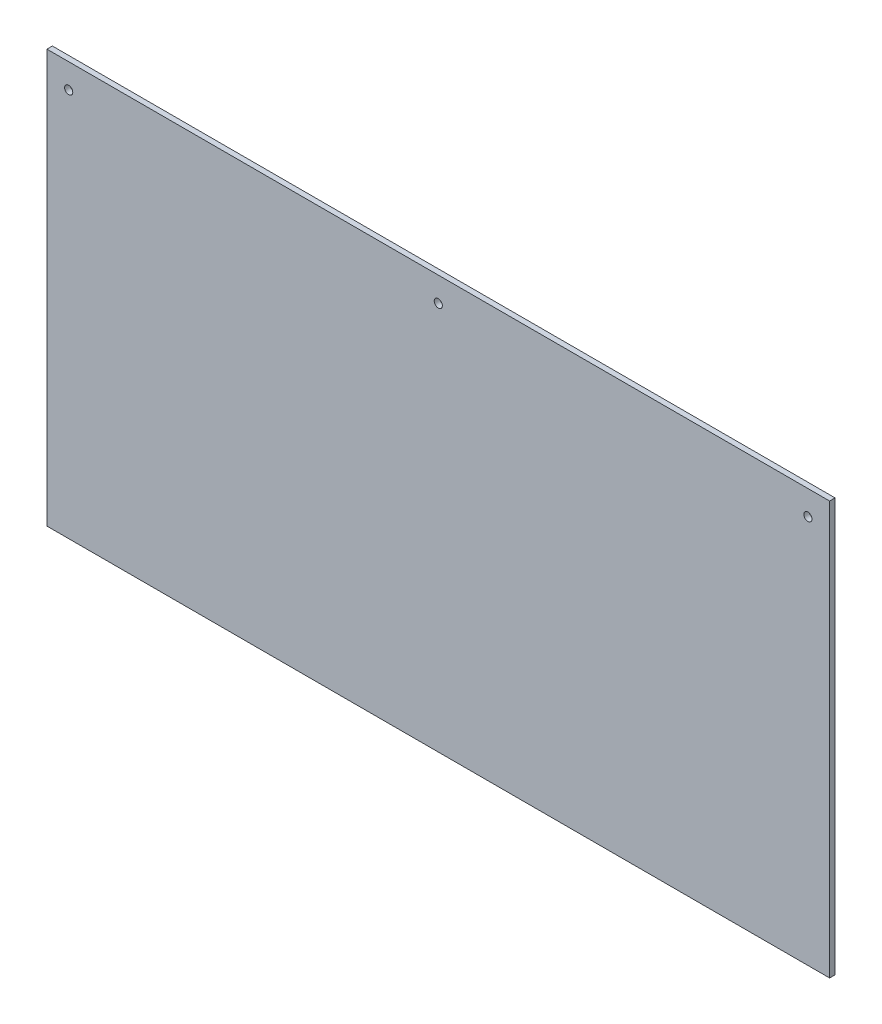
ISO-10303-21;
HEADER;
FILE_DESCRIPTION(('STEP AP214'),'2;1');
FILE_NAME('part.step','',(''),(''),'','','');
FILE_SCHEMA(('AUTOMOTIVE_DESIGN { 1 0 10303 214 1 1 1 1 }'));
ENDSEC;
DATA;
#1=APPLICATION_CONTEXT('core data for automotive mechanical design processes');
#2=APPLICATION_PROTOCOL_DEFINITION('international standard','automotive_design',2000,#1);
#3=PRODUCT_CONTEXT('',#1,'mechanical');
#4=PRODUCT('Part','Part','',(#3));
#5=PRODUCT_RELATED_PRODUCT_CATEGORY('part','',(#4));
#6=PRODUCT_DEFINITION_FORMATION('','',#4);
#7=PRODUCT_DEFINITION_CONTEXT('part definition',#1,'design');
#8=PRODUCT_DEFINITION('design','',#6,#7);
#9=PRODUCT_DEFINITION_SHAPE('','',#8);
#10=(LENGTH_UNIT() NAMED_UNIT(*) SI_UNIT(.MILLI.,.METRE.));
#11=(NAMED_UNIT(*) PLANE_ANGLE_UNIT() SI_UNIT($,.RADIAN.));
#12=(NAMED_UNIT(*) SI_UNIT($,.STERADIAN.) SOLID_ANGLE_UNIT());
#13=UNCERTAINTY_MEASURE_WITH_UNIT(LENGTH_MEASURE(1.E-05),#10,'distance_accuracy_value','');
#14=(GEOMETRIC_REPRESENTATION_CONTEXT(3) GLOBAL_UNCERTAINTY_ASSIGNED_CONTEXT((#13)) GLOBAL_UNIT_ASSIGNED_CONTEXT((#10,
#11,#12)) REPRESENTATION_CONTEXT('',''));
#15=CARTESIAN_POINT('',(0.,0.,0.));
#16=DIRECTION('',(0.,0.,1.));
#17=DIRECTION('',(1.,0.,0.));
#18=AXIS2_PLACEMENT_3D('',#15,#16,#17);
#19=CARTESIAN_POINT('',(0.,0.,6.35));
#20=DIRECTION('',(0.,0.,1.));
#21=DIRECTION('',(1.,0.,0.));
#22=AXIS2_PLACEMENT_3D('',#19,#20,#21);
#23=PLANE('',#22);
#24=CARTESIAN_POINT('',(889.,454.025,6.35));
#25=DIRECTION('',(0.,0.,1.));
#26=DIRECTION('',(1.,0.,0.));
#27=AXIS2_PLACEMENT_3D('',#24,#25,#26);
#28=CIRCLE('',#27,4.7625);
#29=CARTESIAN_POINT('',(893.7625,454.025,6.35));
#30=VERTEX_POINT('',#29);
#31=EDGE_CURVE('E88',#30,#30,#28,.F.);
#32=ORIENTED_EDGE('',*,*,#31,.T.);
#33=EDGE_LOOP('',(#32));
#34=FACE_BOUND('',#33,.T.);
#35=CARTESIAN_POINT('',(457.2,454.025,6.35));
#36=DIRECTION('',(0.,0.,1.));
#37=DIRECTION('',(1.,0.,0.));
#38=AXIS2_PLACEMENT_3D('',#35,#36,#37);
#39=CIRCLE('',#38,4.7625);
#40=CARTESIAN_POINT('',(461.9625,454.025,6.35));
#41=VERTEX_POINT('',#40);
#42=EDGE_CURVE('E90',#41,#41,#39,.F.);
#43=ORIENTED_EDGE('',*,*,#42,.T.);
#44=EDGE_LOOP('',(#43));
#45=FACE_BOUND('',#44,.T.);
#46=CARTESIAN_POINT('',(25.4,454.025,6.35));
#47=DIRECTION('',(0.,0.,1.));
#48=DIRECTION('',(1.,0.,0.));
#49=AXIS2_PLACEMENT_3D('',#46,#47,#48);
#50=CIRCLE('',#49,4.7625);
#51=CARTESIAN_POINT('',(30.1625,454.025,6.35));
#52=VERTEX_POINT('',#51);
#53=EDGE_CURVE('E19',#52,#52,#50,.F.);
#54=ORIENTED_EDGE('',*,*,#53,.T.);
#55=EDGE_LOOP('',(#54));
#56=FACE_BOUND('',#55,.T.);
#57=DIRECTION('',(0.,1.,0.));
#58=VECTOR('',#57,1.);
#59=CARTESIAN_POINT('',(0.,482.6,6.35));
#60=LINE('',#59,#58);
#61=CARTESIAN_POINT('',(0.,0.,6.35));
#62=VERTEX_POINT('',#61);
#63=CARTESIAN_POINT('',(0.,482.6,6.35));
#64=VERTEX_POINT('',#63);
#65=EDGE_CURVE('E70',#62,#64,#60,.T.);
#66=ORIENTED_EDGE('',*,*,#65,.F.);
#67=DIRECTION('',(1.,0.,0.));
#68=VECTOR('',#67,1.);
#69=CARTESIAN_POINT('',(0.,0.,6.35));
#70=LINE('',#69,#68);
#71=CARTESIAN_POINT('',(914.4,0.,6.35));
#72=VERTEX_POINT('',#71);
#73=EDGE_CURVE('E67',#72,#62,#70,.F.);
#74=ORIENTED_EDGE('',*,*,#73,.F.);
#75=DIRECTION('',(0.,1.,0.));
#76=VECTOR('',#75,1.);
#77=CARTESIAN_POINT('',(914.4,0.,6.35));
#78=LINE('',#77,#76);
#79=CARTESIAN_POINT('',(914.4,482.6,6.35));
#80=VERTEX_POINT('',#79);
#81=EDGE_CURVE('E58',#80,#72,#78,.F.);
#82=ORIENTED_EDGE('',*,*,#81,.F.);
#83=DIRECTION('',(1.,0.,0.));
#84=VECTOR('',#83,1.);
#85=CARTESIAN_POINT('',(914.4,482.6,6.35));
#86=LINE('',#85,#84);
#87=EDGE_CURVE('E53',#64,#80,#86,.T.);
#88=ORIENTED_EDGE('',*,*,#87,.F.);
#89=EDGE_LOOP('',(#66,#74,#82,#88));
#90=FACE_BOUND('',#89,.T.);
#91=ADVANCED_FACE('F16',(#34,#45,#56,#90),#23,.T.);
#92=CARTESIAN_POINT('',(0.,0.,0.));
#93=DIRECTION('',(0.,-1.,0.));
#94=DIRECTION('',(0.,0.,-1.));
#95=AXIS2_PLACEMENT_3D('',#92,#93,#94);
#96=PLANE('',#95);
#97=DIRECTION('',(0.,0.,1.));
#98=VECTOR('',#97,1.);
#99=CARTESIAN_POINT('',(0.,0.,0.));
#100=LINE('',#99,#98);
#101=CARTESIAN_POINT('',(0.,0.,0.));
#102=VERTEX_POINT('',#101);
#103=EDGE_CURVE('E98',#102,#62,#100,.T.);
#104=ORIENTED_EDGE('',*,*,#103,.F.);
#105=DIRECTION('',(1.,0.,0.));
#106=VECTOR('',#105,1.);
#107=CARTESIAN_POINT('',(0.,0.,0.));
#108=LINE('',#107,#106);
#109=CARTESIAN_POINT('',(914.4,0.,0.));
#110=VERTEX_POINT('',#109);
#111=EDGE_CURVE('E77',#102,#110,#108,.T.);
#112=ORIENTED_EDGE('',*,*,#111,.T.);
#113=DIRECTION('',(0.,0.,-1.));
#114=VECTOR('',#113,1.);
#115=CARTESIAN_POINT('',(914.4,0.,0.));
#116=LINE('',#115,#114);
#117=EDGE_CURVE('E63',#72,#110,#116,.T.);
#118=ORIENTED_EDGE('',*,*,#117,.F.);
#119=ORIENTED_EDGE('',*,*,#73,.T.);
#120=EDGE_LOOP('',(#104,#112,#118,#119));
#121=FACE_BOUND('',#120,.T.);
#122=ADVANCED_FACE('F76',(#121),#96,.T.);
#123=CARTESIAN_POINT('',(914.4,0.,0.));
#124=DIRECTION('',(1.,0.,0.));
#125=DIRECTION('',(0.,0.,-1.));
#126=AXIS2_PLACEMENT_3D('',#123,#124,#125);
#127=PLANE('',#126);
#128=ORIENTED_EDGE('',*,*,#117,.T.);
#129=DIRECTION('',(0.,1.,0.));
#130=VECTOR('',#129,1.);
#131=CARTESIAN_POINT('',(914.4,0.,0.));
#132=LINE('',#131,#130);
#133=CARTESIAN_POINT('',(914.4,482.6,0.));
#134=VERTEX_POINT('',#133);
#135=EDGE_CURVE('E109',#110,#134,#132,.T.);
#136=ORIENTED_EDGE('',*,*,#135,.T.);
#137=DIRECTION('',(0.,0.,1.));
#138=VECTOR('',#137,1.);
#139=CARTESIAN_POINT('',(914.4,482.6,0.));
#140=LINE('',#139,#138);
#141=EDGE_CURVE('E65',#80,#134,#140,.F.);
#142=ORIENTED_EDGE('',*,*,#141,.F.);
#143=ORIENTED_EDGE('',*,*,#81,.T.);
#144=EDGE_LOOP('',(#128,#136,#142,#143));
#145=FACE_BOUND('',#144,.T.);
#146=ADVANCED_FACE('F60',(#145),#127,.T.);
#147=CARTESIAN_POINT('',(914.4,482.6,0.));
#148=DIRECTION('',(0.,1.,0.));
#149=DIRECTION('',(0.,0.,1.));
#150=AXIS2_PLACEMENT_3D('',#147,#148,#149);
#151=PLANE('',#150);
#152=ORIENTED_EDGE('',*,*,#141,.T.);
#153=DIRECTION('',(1.,0.,0.));
#154=VECTOR('',#153,1.);
#155=CARTESIAN_POINT('',(0.,482.6,0.));
#156=LINE('',#155,#154);
#157=CARTESIAN_POINT('',(0.,482.6,0.));
#158=VERTEX_POINT('',#157);
#159=EDGE_CURVE('E106',#134,#158,#156,.F.);
#160=ORIENTED_EDGE('',*,*,#159,.T.);
#161=DIRECTION('',(0.,0.,1.));
#162=VECTOR('',#161,1.);
#163=CARTESIAN_POINT('',(0.,482.6,0.));
#164=LINE('',#163,#162);
#165=EDGE_CURVE('E34',#64,#158,#164,.F.);
#166=ORIENTED_EDGE('',*,*,#165,.F.);
#167=ORIENTED_EDGE('',*,*,#87,.T.);
#168=EDGE_LOOP('',(#152,#160,#166,#167));
#169=FACE_BOUND('',#168,.T.);
#170=ADVANCED_FACE('F105',(#169),#151,.T.);
#171=CARTESIAN_POINT('',(0.,482.6,0.));
#172=DIRECTION('',(-1.,0.,0.));
#173=DIRECTION('',(0.,0.,1.));
#174=AXIS2_PLACEMENT_3D('',#171,#172,#173);
#175=PLANE('',#174);
#176=ORIENTED_EDGE('',*,*,#165,.T.);
#177=DIRECTION('',(0.,1.,0.));
#178=VECTOR('',#177,1.);
#179=CARTESIAN_POINT('',(0.,0.,0.));
#180=LINE('',#179,#178);
#181=EDGE_CURVE('E87',#158,#102,#180,.F.);
#182=ORIENTED_EDGE('',*,*,#181,.T.);
#183=ORIENTED_EDGE('',*,*,#103,.T.);
#184=ORIENTED_EDGE('',*,*,#65,.T.);
#185=EDGE_LOOP('',(#176,#182,#183,#184));
#186=FACE_BOUND('',#185,.T.);
#187=ADVANCED_FACE('F112',(#186),#175,.T.);
#188=CARTESIAN_POINT('',(25.4,454.025,0.));
#189=DIRECTION('',(0.,0.,1.));
#190=DIRECTION('',(1.,0.,0.));
#191=AXIS2_PLACEMENT_3D('',#188,#189,#190);
#192=CYLINDRICAL_SURFACE('',#191,4.7625);
#193=ORIENTED_EDGE('',*,*,#53,.F.);
#194=EDGE_LOOP('',(#193));
#195=FACE_BOUND('',#194,.T.);
#196=CARTESIAN_POINT('',(25.4,454.025,0.));
#197=DIRECTION('',(0.,0.,1.));
#198=DIRECTION('',(1.,0.,0.));
#199=AXIS2_PLACEMENT_3D('',#196,#197,#198);
#200=CIRCLE('',#199,4.7625);
#201=CARTESIAN_POINT('',(30.1625,454.025,0.));
#202=VERTEX_POINT('',#201);
#203=EDGE_CURVE('E84',#202,#202,#200,.F.);
#204=ORIENTED_EDGE('',*,*,#203,.T.);
#205=EDGE_LOOP('',(#204));
#206=FACE_BOUND('',#205,.T.);
#207=ADVANCED_FACE('F114',(#195,#206),#192,.F.);
#208=CARTESIAN_POINT('',(457.2,454.025,0.));
#209=DIRECTION('',(0.,0.,1.));
#210=DIRECTION('',(1.,0.,0.));
#211=AXIS2_PLACEMENT_3D('',#208,#209,#210);
#212=CYLINDRICAL_SURFACE('',#211,4.7625);
#213=ORIENTED_EDGE('',*,*,#42,.F.);
#214=EDGE_LOOP('',(#213));
#215=FACE_BOUND('',#214,.T.);
#216=CARTESIAN_POINT('',(457.2,454.025,0.));
#217=DIRECTION('',(0.,0.,1.));
#218=DIRECTION('',(1.,0.,0.));
#219=AXIS2_PLACEMENT_3D('',#216,#217,#218);
#220=CIRCLE('',#219,4.7625);
#221=CARTESIAN_POINT('',(461.9625,454.025,0.));
#222=VERTEX_POINT('',#221);
#223=EDGE_CURVE('E25',#222,#222,#220,.F.);
#224=ORIENTED_EDGE('',*,*,#223,.T.);
#225=EDGE_LOOP('',(#224));
#226=FACE_BOUND('',#225,.T.);
#227=ADVANCED_FACE('F121',(#215,#226),#212,.F.);
#228=CARTESIAN_POINT('',(889.,454.025,0.));
#229=DIRECTION('',(0.,0.,1.));
#230=DIRECTION('',(1.,0.,0.));
#231=AXIS2_PLACEMENT_3D('',#228,#229,#230);
#232=CYLINDRICAL_SURFACE('',#231,4.7625);
#233=ORIENTED_EDGE('',*,*,#31,.F.);
#234=EDGE_LOOP('',(#233));
#235=FACE_BOUND('',#234,.T.);
#236=CARTESIAN_POINT('',(889.,454.025,0.));
#237=DIRECTION('',(0.,0.,1.));
#238=DIRECTION('',(1.,0.,0.));
#239=AXIS2_PLACEMENT_3D('',#236,#237,#238);
#240=CIRCLE('',#239,4.7625);
#241=CARTESIAN_POINT('',(893.7625,454.025,0.));
#242=VERTEX_POINT('',#241);
#243=EDGE_CURVE('E11',#242,#242,#240,.F.);
#244=ORIENTED_EDGE('',*,*,#243,.T.);
#245=EDGE_LOOP('',(#244));
#246=FACE_BOUND('',#245,.T.);
#247=ADVANCED_FACE('F126',(#235,#246),#232,.F.);
#248=CARTESIAN_POINT('',(0.,0.,0.));
#249=DIRECTION('',(0.,0.,1.));
#250=DIRECTION('',(1.,0.,0.));
#251=AXIS2_PLACEMENT_3D('',#248,#249,#250);
#252=PLANE('',#251);
#253=ORIENTED_EDGE('',*,*,#243,.F.);
#254=EDGE_LOOP('',(#253));
#255=FACE_BOUND('',#254,.T.);
#256=ORIENTED_EDGE('',*,*,#223,.F.);
#257=EDGE_LOOP('',(#256));
#258=FACE_BOUND('',#257,.T.);
#259=ORIENTED_EDGE('',*,*,#203,.F.);
#260=EDGE_LOOP('',(#259));
#261=FACE_BOUND('',#260,.T.);
#262=ORIENTED_EDGE('',*,*,#159,.F.);
#263=ORIENTED_EDGE('',*,*,#135,.F.);
#264=ORIENTED_EDGE('',*,*,#111,.F.);
#265=ORIENTED_EDGE('',*,*,#181,.F.);
#266=EDGE_LOOP('',(#262,#263,#264,#265));
#267=FACE_BOUND('',#266,.T.);
#268=ADVANCED_FACE('F108',(#255,#258,#261,#267),#252,.F.);
#269=CLOSED_SHELL('',(#91,#122,#146,#170,#187,#207,#227,#247,#268));
#270=MANIFOLD_SOLID_BREP('B1',#269);
#271=ADVANCED_BREP_SHAPE_REPRESENTATION('',(#18,#270),#14);
#272=SHAPE_DEFINITION_REPRESENTATION(#9,#271);
ENDSEC;
END-ISO-10303-21;
